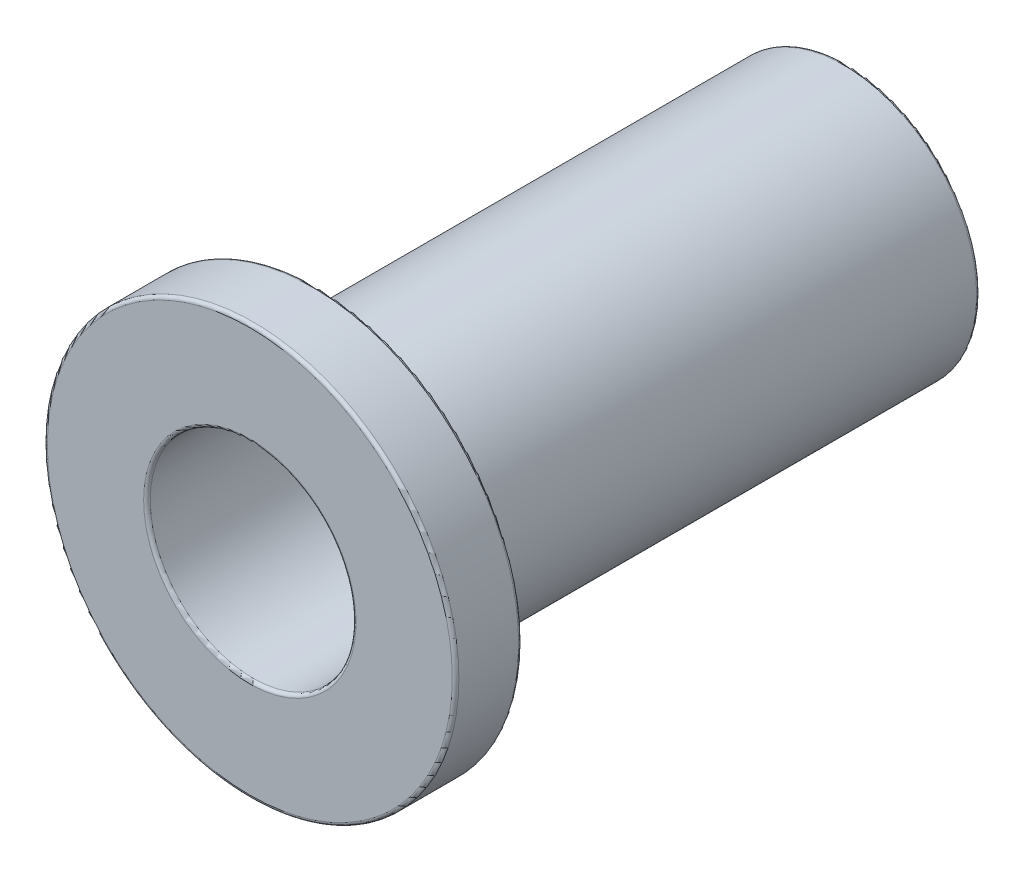
ISO-10303-21;
HEADER;
FILE_DESCRIPTION(('STEP AP214'),'2;1');
FILE_NAME('part.step','',(''),(''),'','','');
FILE_SCHEMA(('AUTOMOTIVE_DESIGN { 1 0 10303 214 1 1 1 1 }'));
ENDSEC;
DATA;
#1=APPLICATION_CONTEXT('core data for automotive mechanical design processes');
#2=APPLICATION_PROTOCOL_DEFINITION('international standard','automotive_design',2000,#1);
#3=PRODUCT_CONTEXT('',#1,'mechanical');
#4=PRODUCT('Part','Part','',(#3));
#5=PRODUCT_RELATED_PRODUCT_CATEGORY('part','',(#4));
#6=PRODUCT_DEFINITION_FORMATION('','',#4);
#7=PRODUCT_DEFINITION_CONTEXT('part definition',#1,'design');
#8=PRODUCT_DEFINITION('design','',#6,#7);
#9=PRODUCT_DEFINITION_SHAPE('','',#8);
#10=(LENGTH_UNIT() NAMED_UNIT(*) SI_UNIT(.MILLI.,.METRE.));
#11=(NAMED_UNIT(*) PLANE_ANGLE_UNIT() SI_UNIT($,.RADIAN.));
#12=(NAMED_UNIT(*) SI_UNIT($,.STERADIAN.) SOLID_ANGLE_UNIT());
#13=UNCERTAINTY_MEASURE_WITH_UNIT(LENGTH_MEASURE(1.E-05),#10,'distance_accuracy_value','');
#14=(GEOMETRIC_REPRESENTATION_CONTEXT(3) GLOBAL_UNCERTAINTY_ASSIGNED_CONTEXT((#13)) GLOBAL_UNIT_ASSIGNED_CONTEXT((#10,
#11,#12)) REPRESENTATION_CONTEXT('',''));
#15=CARTESIAN_POINT('',(0.,0.,0.));
#16=DIRECTION('',(0.,0.,1.));
#17=DIRECTION('',(1.,0.,0.));
#18=AXIS2_PLACEMENT_3D('',#15,#16,#17);
#19=CARTESIAN_POINT('',(0.,3.1,4.5));
#20=DIRECTION('',(0.,0.,-1.));
#21=DIRECTION('',(-1.,0.,0.));
#22=AXIS2_PLACEMENT_3D('',#19,#20,#21);
#23=PLANE('',#22);
#24=CARTESIAN_POINT('',(0.,0.,4.5));
#25=DIRECTION('',(0.,0.,-1.));
#26=DIRECTION('',(-1.,0.,0.));
#27=AXIS2_PLACEMENT_3D('',#24,#25,#26);
#28=CIRCLE('',#27,1.6);
#29=CARTESIAN_POINT('',(-1.6,0.,4.5));
#30=VERTEX_POINT('',#29);
#31=EDGE_CURVE('E62',#30,#30,#28,.T.);
#32=ORIENTED_EDGE('',*,*,#31,.T.);
#33=EDGE_LOOP('',(#32));
#34=FACE_BOUND('',#33,.T.);
#35=CARTESIAN_POINT('',(0.,0.,4.5));
#36=DIRECTION('',(0.,0.,-1.));
#37=DIRECTION('',(-1.,0.,0.));
#38=AXIS2_PLACEMENT_3D('',#35,#36,#37);
#39=CIRCLE('',#38,3.05);
#40=CARTESIAN_POINT('',(-3.05,0.,4.5));
#41=VERTEX_POINT('',#40);
#42=EDGE_CURVE('E65',#41,#41,#39,.F.);
#43=ORIENTED_EDGE('',*,*,#42,.T.);
#44=EDGE_LOOP('',(#43));
#45=FACE_BOUND('',#44,.T.);
#46=ADVANCED_FACE('F30',(#34,#45),#23,.F.);
#47=CARTESIAN_POINT('',(0.,0.,4.5));
#48=DIRECTION('',(0.,0.,1.));
#49=DIRECTION('',(1.,0.,0.));
#50=AXIS2_PLACEMENT_3D('',#47,#48,#49);
#51=CYLINDRICAL_SURFACE('',#50,1.55);
#52=CARTESIAN_POINT('',(0.,0.,4.45));
#53=DIRECTION('',(0.,0.,-1.));
#54=DIRECTION('',(-1.,0.,0.));
#55=AXIS2_PLACEMENT_3D('',#52,#53,#54);
#56=CIRCLE('',#55,1.55);
#57=CARTESIAN_POINT('',(-1.55,0.,4.45));
#58=VERTEX_POINT('',#57);
#59=EDGE_CURVE('E68',#58,#58,#56,.F.);
#60=ORIENTED_EDGE('',*,*,#59,.T.);
#61=EDGE_LOOP('',(#60));
#62=FACE_BOUND('',#61,.T.);
#63=CARTESIAN_POINT('',(0.,0.,-4.45));
#64=DIRECTION('',(0.,0.,1.));
#65=DIRECTION('',(1.,0.,0.));
#66=AXIS2_PLACEMENT_3D('',#63,#64,#65);
#67=CIRCLE('',#66,1.55);
#68=CARTESIAN_POINT('',(1.55,0.,-4.45));
#69=VERTEX_POINT('',#68);
#70=EDGE_CURVE('E71',#69,#69,#67,.F.);
#71=ORIENTED_EDGE('',*,*,#70,.T.);
#72=EDGE_LOOP('',(#71));
#73=FACE_BOUND('',#72,.T.);
#74=ADVANCED_FACE('F75',(#62,#73),#51,.F.);
#75=CARTESIAN_POINT('',(0.,1.55,-4.5));
#76=DIRECTION('',(0.,0.,1.));
#77=DIRECTION('',(1.,0.,0.));
#78=AXIS2_PLACEMENT_3D('',#75,#76,#77);
#79=PLANE('',#78);
#80=CARTESIAN_POINT('',(0.,0.,-4.5));
#81=DIRECTION('',(0.,0.,1.));
#82=DIRECTION('',(1.,0.,0.));
#83=AXIS2_PLACEMENT_3D('',#80,#81,#82);
#84=CIRCLE('',#83,1.6);
#85=CARTESIAN_POINT('',(1.6,0.,-4.5));
#86=VERTEX_POINT('',#85);
#87=EDGE_CURVE('E56',#86,#86,#84,.T.);
#88=ORIENTED_EDGE('',*,*,#87,.T.);
#89=EDGE_LOOP('',(#88));
#90=FACE_BOUND('',#89,.T.);
#91=CARTESIAN_POINT('',(0.,0.,-4.5));
#92=DIRECTION('',(0.,0.,1.));
#93=DIRECTION('',(1.,0.,0.));
#94=AXIS2_PLACEMENT_3D('',#91,#92,#93);
#95=CIRCLE('',#94,1.95);
#96=CARTESIAN_POINT('',(1.95,0.,-4.5));
#97=VERTEX_POINT('',#96);
#98=EDGE_CURVE('E59',#97,#97,#95,.F.);
#99=ORIENTED_EDGE('',*,*,#98,.T.);
#100=EDGE_LOOP('',(#99));
#101=FACE_BOUND('',#100,.T.);
#102=ADVANCED_FACE('F85',(#90,#101),#79,.F.);
#103=CARTESIAN_POINT('',(0.,0.,4.5));
#104=DIRECTION('',(0.,0.,1.));
#105=DIRECTION('',(1.,0.,0.));
#106=AXIS2_PLACEMENT_3D('',#103,#104,#105);
#107=CYLINDRICAL_SURFACE('',#106,2.);
#108=CARTESIAN_POINT('',(0.,0.,-4.45));
#109=DIRECTION('',(0.,0.,1.));
#110=DIRECTION('',(1.,0.,0.));
#111=AXIS2_PLACEMENT_3D('',#108,#109,#110);
#112=CIRCLE('',#111,2.);
#113=CARTESIAN_POINT('',(2.,0.,-4.45));
#114=VERTEX_POINT('',#113);
#115=EDGE_CURVE('E50',#114,#114,#112,.T.);
#116=ORIENTED_EDGE('',*,*,#115,.T.);
#117=EDGE_LOOP('',(#116));
#118=FACE_BOUND('',#117,.T.);
#119=CARTESIAN_POINT('',(0.,0.,3.45));
#120=DIRECTION('',(0.,0.,1.));
#121=DIRECTION('',(1.,0.,0.));
#122=AXIS2_PLACEMENT_3D('',#119,#120,#121);
#123=CIRCLE('',#122,2.);
#124=CARTESIAN_POINT('',(2.,0.,3.45));
#125=VERTEX_POINT('',#124);
#126=EDGE_CURVE('E53',#125,#125,#123,.F.);
#127=ORIENTED_EDGE('',*,*,#126,.T.);
#128=EDGE_LOOP('',(#127));
#129=FACE_BOUND('',#128,.T.);
#130=ADVANCED_FACE('F88',(#118,#129),#107,.T.);
#131=CARTESIAN_POINT('',(0.,2.,3.5));
#132=DIRECTION('',(0.,0.,1.));
#133=DIRECTION('',(1.,0.,0.));
#134=AXIS2_PLACEMENT_3D('',#131,#132,#133);
#135=PLANE('',#134);
#136=CARTESIAN_POINT('',(0.,0.,3.5));
#137=DIRECTION('',(0.,0.,1.));
#138=DIRECTION('',(1.,0.,0.));
#139=AXIS2_PLACEMENT_3D('',#136,#137,#138);
#140=CIRCLE('',#139,2.05);
#141=CARTESIAN_POINT('',(2.05,0.,3.5));
#142=VERTEX_POINT('',#141);
#143=EDGE_CURVE('E41',#142,#142,#140,.T.);
#144=ORIENTED_EDGE('',*,*,#143,.T.);
#145=EDGE_LOOP('',(#144));
#146=FACE_BOUND('',#145,.T.);
#147=CARTESIAN_POINT('',(0.,0.,3.5));
#148=DIRECTION('',(0.,0.,1.));
#149=DIRECTION('',(1.,0.,0.));
#150=AXIS2_PLACEMENT_3D('',#147,#148,#149);
#151=CIRCLE('',#150,3.05);
#152=CARTESIAN_POINT('',(3.05,0.,3.5));
#153=VERTEX_POINT('',#152);
#154=EDGE_CURVE('E45',#153,#153,#151,.F.);
#155=ORIENTED_EDGE('',*,*,#154,.T.);
#156=EDGE_LOOP('',(#155));
#157=FACE_BOUND('',#156,.T.);
#158=ADVANCED_FACE('F100',(#146,#157),#135,.F.);
#159=CARTESIAN_POINT('',(0.,0.,4.5));
#160=DIRECTION('',(0.,0.,1.));
#161=DIRECTION('',(1.,0.,0.));
#162=AXIS2_PLACEMENT_3D('',#159,#160,#161);
#163=CYLINDRICAL_SURFACE('',#162,3.1);
#164=CARTESIAN_POINT('',(0.,0.,3.55));
#165=DIRECTION('',(0.,0.,1.));
#166=DIRECTION('',(1.,0.,0.));
#167=AXIS2_PLACEMENT_3D('',#164,#165,#166);
#168=CIRCLE('',#167,3.1);
#169=CARTESIAN_POINT('',(3.1,0.,3.55));
#170=VERTEX_POINT('',#169);
#171=EDGE_CURVE('E10',#170,#170,#168,.T.);
#172=ORIENTED_EDGE('',*,*,#171,.T.);
#173=EDGE_LOOP('',(#172));
#174=FACE_BOUND('',#173,.T.);
#175=CARTESIAN_POINT('',(0.,0.,4.45));
#176=DIRECTION('',(0.,0.,-1.));
#177=DIRECTION('',(-1.,0.,0.));
#178=AXIS2_PLACEMENT_3D('',#175,#176,#177);
#179=CIRCLE('',#178,3.1);
#180=CARTESIAN_POINT('',(-3.1,0.,4.45));
#181=VERTEX_POINT('',#180);
#182=EDGE_CURVE('E37',#181,#181,#179,.T.);
#183=ORIENTED_EDGE('',*,*,#182,.T.);
#184=EDGE_LOOP('',(#183));
#185=FACE_BOUND('',#184,.T.);
#186=ADVANCED_FACE('F112',(#174,#185),#163,.T.);
#187=CARTESIAN_POINT('',(0.,0.,4.45));
#188=DIRECTION('',(0.,0.,-1.));
#189=DIRECTION('',(-1.,0.,0.));
#190=AXIS2_PLACEMENT_3D('',#187,#188,#189);
#191=TOROIDAL_SURFACE('',#190,1.6,0.05);
#192=ORIENTED_EDGE('',*,*,#31,.F.);
#193=EDGE_LOOP('',(#192));
#194=FACE_BOUND('',#193,.T.);
#195=ORIENTED_EDGE('',*,*,#59,.F.);
#196=EDGE_LOOP('',(#195));
#197=FACE_BOUND('',#196,.T.);
#198=ADVANCED_FACE('F81',(#194,#197),#191,.T.);
#199=CARTESIAN_POINT('',(0.,0.,-4.45));
#200=DIRECTION('',(0.,0.,1.));
#201=DIRECTION('',(1.,0.,0.));
#202=AXIS2_PLACEMENT_3D('',#199,#200,#201);
#203=TOROIDAL_SURFACE('',#202,1.6,0.05);
#204=ORIENTED_EDGE('',*,*,#70,.F.);
#205=EDGE_LOOP('',(#204));
#206=FACE_BOUND('',#205,.T.);
#207=ORIENTED_EDGE('',*,*,#87,.F.);
#208=EDGE_LOOP('',(#207));
#209=FACE_BOUND('',#208,.T.);
#210=ADVANCED_FACE('F77',(#206,#209),#203,.T.);
#211=CARTESIAN_POINT('',(0.,0.,-4.45));
#212=DIRECTION('',(0.,0.,1.));
#213=DIRECTION('',(1.,0.,0.));
#214=AXIS2_PLACEMENT_3D('',#211,#212,#213);
#215=TOROIDAL_SURFACE('',#214,1.95,0.05);
#216=ORIENTED_EDGE('',*,*,#98,.F.);
#217=EDGE_LOOP('',(#216));
#218=FACE_BOUND('',#217,.T.);
#219=ORIENTED_EDGE('',*,*,#115,.F.);
#220=EDGE_LOOP('',(#219));
#221=FACE_BOUND('',#220,.T.);
#222=ADVANCED_FACE('F80',(#218,#221),#215,.T.);
#223=CARTESIAN_POINT('',(0.,0.,3.45));
#224=DIRECTION('',(0.,0.,1.));
#225=DIRECTION('',(1.,0.,0.));
#226=AXIS2_PLACEMENT_3D('',#223,#224,#225);
#227=TOROIDAL_SURFACE('',#226,2.05,0.05);
#228=ORIENTED_EDGE('',*,*,#126,.F.);
#229=EDGE_LOOP('',(#228));
#230=FACE_BOUND('',#229,.T.);
#231=ORIENTED_EDGE('',*,*,#143,.F.);
#232=EDGE_LOOP('',(#231));
#233=FACE_BOUND('',#232,.T.);
#234=ADVANCED_FACE('F94',(#230,#233),#227,.F.);
#235=CARTESIAN_POINT('',(0.,0.,3.55));
#236=DIRECTION('',(0.,0.,1.));
#237=DIRECTION('',(1.,0.,0.));
#238=AXIS2_PLACEMENT_3D('',#235,#236,#237);
#239=TOROIDAL_SURFACE('',#238,3.05,0.05);
#240=ORIENTED_EDGE('',*,*,#154,.F.);
#241=EDGE_LOOP('',(#240));
#242=FACE_BOUND('',#241,.T.);
#243=ORIENTED_EDGE('',*,*,#171,.F.);
#244=EDGE_LOOP('',(#243));
#245=FACE_BOUND('',#244,.T.);
#246=ADVANCED_FACE('F106',(#242,#245),#239,.T.);
#247=CARTESIAN_POINT('',(0.,0.,4.45));
#248=DIRECTION('',(0.,0.,-1.));
#249=DIRECTION('',(-1.,0.,0.));
#250=AXIS2_PLACEMENT_3D('',#247,#248,#249);
#251=TOROIDAL_SURFACE('',#250,3.05,0.05);
#252=ORIENTED_EDGE('',*,*,#182,.F.);
#253=EDGE_LOOP('',(#252));
#254=FACE_BOUND('',#253,.T.);
#255=ORIENTED_EDGE('',*,*,#42,.F.);
#256=EDGE_LOOP('',(#255));
#257=FACE_BOUND('',#256,.T.);
#258=ADVANCED_FACE('F32',(#254,#257),#251,.T.);
#259=CLOSED_SHELL('',(#46,#74,#102,#130,#158,#186,#198,#210,#222,#234,#246,#258));
#260=MANIFOLD_SOLID_BREP('B2',#259);
#261=ADVANCED_BREP_SHAPE_REPRESENTATION('',(#18,#260),#14);
#262=SHAPE_DEFINITION_REPRESENTATION(#9,#261);
ENDSEC;
END-ISO-10303-21;
